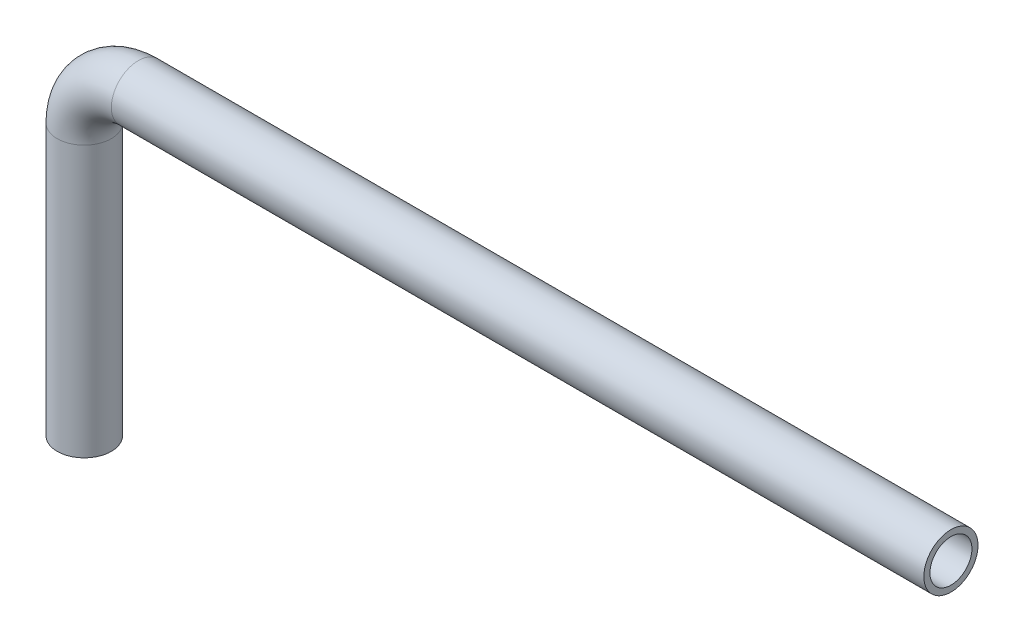
ISO-10303-21;
HEADER;
FILE_DESCRIPTION(('STEP AP214'),'2;1');
FILE_NAME('part.step','',(''),(''),'','','');
FILE_SCHEMA(('AUTOMOTIVE_DESIGN { 1 0 10303 214 1 1 1 1 }'));
ENDSEC;
DATA;
#1=APPLICATION_CONTEXT('core data for automotive mechanical design processes');
#2=APPLICATION_PROTOCOL_DEFINITION('international standard','automotive_design',2000,#1);
#3=PRODUCT_CONTEXT('',#1,'mechanical');
#4=PRODUCT('Part','Part','',(#3));
#5=PRODUCT_RELATED_PRODUCT_CATEGORY('part','',(#4));
#6=PRODUCT_DEFINITION_FORMATION('','',#4);
#7=PRODUCT_DEFINITION_CONTEXT('part definition',#1,'design');
#8=PRODUCT_DEFINITION('design','',#6,#7);
#9=PRODUCT_DEFINITION_SHAPE('','',#8);
#10=(LENGTH_UNIT() NAMED_UNIT(*) SI_UNIT(.MILLI.,.METRE.));
#11=(NAMED_UNIT(*) PLANE_ANGLE_UNIT() SI_UNIT($,.RADIAN.));
#12=(NAMED_UNIT(*) SI_UNIT($,.STERADIAN.) SOLID_ANGLE_UNIT());
#13=UNCERTAINTY_MEASURE_WITH_UNIT(LENGTH_MEASURE(1.E-05),#10,'distance_accuracy_value','');
#14=(GEOMETRIC_REPRESENTATION_CONTEXT(3) GLOBAL_UNCERTAINTY_ASSIGNED_CONTEXT((#13)) GLOBAL_UNIT_ASSIGNED_CONTEXT((#10,
#11,#12)) REPRESENTATION_CONTEXT('',''));
#15=CARTESIAN_POINT('',(0.,0.,0.));
#16=DIRECTION('',(0.,0.,1.));
#17=DIRECTION('',(1.,0.,0.));
#18=AXIS2_PLACEMENT_3D('',#15,#16,#17);
#19=CARTESIAN_POINT('',(0.,0.,0.));
#20=DIRECTION('',(0.,1.,0.));
#21=DIRECTION('',(0.,0.,1.));
#22=AXIS2_PLACEMENT_3D('',#19,#20,#21);
#23=CYLINDRICAL_SURFACE('',#22,1.5875);
#24=CARTESIAN_POINT('',(0.,15.875,0.));
#25=DIRECTION('',(0.,1.,0.));
#26=DIRECTION('',(0.,0.,1.));
#27=AXIS2_PLACEMENT_3D('',#24,#25,#26);
#28=CIRCLE('',#27,1.5875);
#29=CARTESIAN_POINT('',(-1.5875,15.875,0.));
#30=VERTEX_POINT('',#29);
#31=EDGE_CURVE('E79',#30,#30,#28,.T.);
#32=ORIENTED_EDGE('',*,*,#31,.F.);
#33=EDGE_LOOP('',(#32));
#34=FACE_BOUND('',#33,.T.);
#35=CARTESIAN_POINT('',(0.,0.,0.));
#36=DIRECTION('',(0.,1.,0.));
#37=DIRECTION('',(0.,0.,1.));
#38=AXIS2_PLACEMENT_3D('',#35,#36,#37);
#39=CIRCLE('',#38,1.5875);
#40=CARTESIAN_POINT('',(0.,0.,1.5875));
#41=VERTEX_POINT('',#40);
#42=EDGE_CURVE('E48',#41,#41,#39,.T.);
#43=ORIENTED_EDGE('',*,*,#42,.T.);
#44=EDGE_LOOP('',(#43));
#45=FACE_BOUND('',#44,.T.);
#46=ADVANCED_FACE('F33',(#34,#45),#23,.T.);
#47=CARTESIAN_POINT('',(3.175,15.875,0.));
#48=DIRECTION('',(0.,0.,-1.));
#49=DIRECTION('',(-1.,0.,0.));
#50=AXIS2_PLACEMENT_3D('',#47,#48,#49);
#51=TOROIDAL_SURFACE('',#50,3.175,1.5875);
#52=CARTESIAN_POINT('',(3.175,19.05,0.));
#53=DIRECTION('',(1.,0.,0.));
#54=DIRECTION('',(0.,0.,1.));
#55=AXIS2_PLACEMENT_3D('',#52,#53,#54);
#56=CIRCLE('',#55,1.5875);
#57=CARTESIAN_POINT('',(3.175,20.6375,0.));
#58=VERTEX_POINT('',#57);
#59=EDGE_CURVE('E37',#58,#58,#56,.T.);
#60=CARTESIAN_POINT('',(3.175,15.875,0.));
#61=DIRECTION('',(0.,0.,-1.));
#62=DIRECTION('',(-1.,0.,0.));
#63=AXIS2_PLACEMENT_3D('',#60,#61,#62);
#64=CIRCLE('',#63,4.7625);
#65=EDGE_CURVE('',#30,#58,#64,.T.);
#66=ORIENTED_EDGE('',*,*,#31,.T.);
#67=ORIENTED_EDGE('',*,*,#59,.F.);
#68=ORIENTED_EDGE('',*,*,#65,.T.);
#69=ORIENTED_EDGE('',*,*,#65,.F.);
#70=EDGE_LOOP('',(#66,#68,#67,#69));
#71=FACE_BOUND('',#70,.T.);
#72=ADVANCED_FACE('F87',(#71),#51,.T.);
#73=CARTESIAN_POINT('',(3.175,19.05,0.));
#74=DIRECTION('',(1.,0.,0.));
#75=DIRECTION('',(0.,1.,0.));
#76=AXIS2_PLACEMENT_3D('',#73,#74,#75);
#77=CYLINDRICAL_SURFACE('',#76,1.5875);
#78=CARTESIAN_POINT('',(50.8,19.05,0.));
#79=DIRECTION('',(1.,0.,0.));
#80=DIRECTION('',(0.,0.,1.));
#81=AXIS2_PLACEMENT_3D('',#78,#79,#80);
#82=CIRCLE('',#81,1.5875);
#83=CARTESIAN_POINT('',(50.8,19.05,1.5875));
#84=VERTEX_POINT('',#83);
#85=EDGE_CURVE('E53',#84,#84,#82,.T.);
#86=ORIENTED_EDGE('',*,*,#85,.F.);
#87=EDGE_LOOP('',(#86));
#88=FACE_BOUND('',#87,.T.);
#89=ORIENTED_EDGE('',*,*,#59,.T.);
#90=EDGE_LOOP('',(#89));
#91=FACE_BOUND('',#90,.T.);
#92=ADVANCED_FACE('F35',(#88,#91),#77,.T.);
#93=CARTESIAN_POINT('',(0.,0.,0.));
#94=DIRECTION('',(0.,1.,0.));
#95=DIRECTION('',(0.,0.,1.));
#96=AXIS2_PLACEMENT_3D('',#93,#94,#95);
#97=PLANE('',#96);
#98=CARTESIAN_POINT('',(0.,0.,0.));
#99=DIRECTION('',(0.,1.,0.));
#100=DIRECTION('',(0.,0.,1.));
#101=AXIS2_PLACEMENT_3D('',#98,#99,#100);
#102=CIRCLE('',#101,1.2319);
#103=CARTESIAN_POINT('',(0.,0.,1.2319));
#104=VERTEX_POINT('',#103);
#105=EDGE_CURVE('E74',#104,#104,#102,.F.);
#106=ORIENTED_EDGE('',*,*,#105,.F.);
#107=EDGE_LOOP('',(#106));
#108=FACE_BOUND('',#107,.T.);
#109=ORIENTED_EDGE('',*,*,#42,.F.);
#110=EDGE_LOOP('',(#109));
#111=FACE_BOUND('',#110,.T.);
#112=ADVANCED_FACE('F93',(#108,#111),#97,.F.);
#113=CARTESIAN_POINT('',(50.8,19.05,0.));
#114=DIRECTION('',(1.,0.,0.));
#115=DIRECTION('',(0.,0.,1.));
#116=AXIS2_PLACEMENT_3D('',#113,#114,#115);
#117=PLANE('',#116);
#118=CARTESIAN_POINT('',(50.8,19.05,0.));
#119=DIRECTION('',(1.,0.,0.));
#120=DIRECTION('',(0.,0.,1.));
#121=AXIS2_PLACEMENT_3D('',#118,#119,#120);
#122=CIRCLE('',#121,1.2319);
#123=CARTESIAN_POINT('',(50.8,19.05,1.2319));
#124=VERTEX_POINT('',#123);
#125=EDGE_CURVE('E11',#124,#124,#122,.F.);
#126=ORIENTED_EDGE('',*,*,#125,.T.);
#127=EDGE_LOOP('',(#126));
#128=FACE_BOUND('',#127,.T.);
#129=ORIENTED_EDGE('',*,*,#85,.T.);
#130=EDGE_LOOP('',(#129));
#131=FACE_BOUND('',#130,.T.);
#132=ADVANCED_FACE('F60',(#128,#131),#117,.T.);
#133=CARTESIAN_POINT('',(0.,0.,0.));
#134=DIRECTION('',(0.,1.,0.));
#135=DIRECTION('',(0.,0.,1.));
#136=AXIS2_PLACEMENT_3D('',#133,#134,#135);
#137=CYLINDRICAL_SURFACE('',#136,1.2319);
#138=CARTESIAN_POINT('',(0.,15.875,0.));
#139=DIRECTION('',(0.,1.,0.));
#140=DIRECTION('',(0.,0.,1.));
#141=AXIS2_PLACEMENT_3D('',#138,#139,#140);
#142=CIRCLE('',#141,1.2319);
#143=CARTESIAN_POINT('',(-1.2319,15.875,0.));
#144=VERTEX_POINT('',#143);
#145=EDGE_CURVE('E71',#144,#144,#142,.F.);
#146=ORIENTED_EDGE('',*,*,#145,.F.);
#147=EDGE_LOOP('',(#146));
#148=FACE_BOUND('',#147,.T.);
#149=ORIENTED_EDGE('',*,*,#105,.T.);
#150=EDGE_LOOP('',(#149));
#151=FACE_BOUND('',#150,.T.);
#152=ADVANCED_FACE('F101',(#148,#151),#137,.F.);
#153=CARTESIAN_POINT('',(3.175,15.875,0.));
#154=DIRECTION('',(0.,0.,-1.));
#155=DIRECTION('',(-1.,0.,0.));
#156=AXIS2_PLACEMENT_3D('',#153,#154,#155);
#157=TOROIDAL_SURFACE('',#156,3.175,1.2319);
#158=CARTESIAN_POINT('',(3.175,19.05,0.));
#159=DIRECTION('',(1.,0.,0.));
#160=DIRECTION('',(0.,0.,1.));
#161=AXIS2_PLACEMENT_3D('',#158,#159,#160);
#162=CIRCLE('',#161,1.2319);
#163=CARTESIAN_POINT('',(3.175,20.2819,0.));
#164=VERTEX_POINT('',#163);
#165=EDGE_CURVE('E42',#164,#164,#162,.F.);
#166=CARTESIAN_POINT('',(3.175,15.875,0.));
#167=DIRECTION('',(0.,0.,-1.));
#168=DIRECTION('',(-1.,0.,0.));
#169=AXIS2_PLACEMENT_3D('',#166,#167,#168);
#170=CIRCLE('',#169,4.4069);
#171=EDGE_CURVE('',#144,#164,#170,.T.);
#172=ORIENTED_EDGE('',*,*,#145,.T.);
#173=ORIENTED_EDGE('',*,*,#165,.F.);
#174=ORIENTED_EDGE('',*,*,#171,.T.);
#175=ORIENTED_EDGE('',*,*,#171,.F.);
#176=EDGE_LOOP('',(#172,#174,#173,#175));
#177=FACE_BOUND('',#176,.T.);
#178=ADVANCED_FACE('F66',(#177),#157,.F.);
#179=CARTESIAN_POINT('',(3.175,19.05,0.));
#180=DIRECTION('',(1.,0.,0.));
#181=DIRECTION('',(0.,1.,0.));
#182=AXIS2_PLACEMENT_3D('',#179,#180,#181);
#183=CYLINDRICAL_SURFACE('',#182,1.2319);
#184=ORIENTED_EDGE('',*,*,#125,.F.);
#185=EDGE_LOOP('',(#184));
#186=FACE_BOUND('',#185,.T.);
#187=ORIENTED_EDGE('',*,*,#165,.T.);
#188=EDGE_LOOP('',(#187));
#189=FACE_BOUND('',#188,.T.);
#190=ADVANCED_FACE('F63',(#186,#189),#183,.F.);
#191=CLOSED_SHELL('',(#46,#72,#92,#112,#132,#152,#178,#190));
#192=MANIFOLD_SOLID_BREP('B2',#191);
#193=ADVANCED_BREP_SHAPE_REPRESENTATION('',(#18,#192),#14);
#194=SHAPE_DEFINITION_REPRESENTATION(#9,#193);
ENDSEC;
END-ISO-10303-21;
